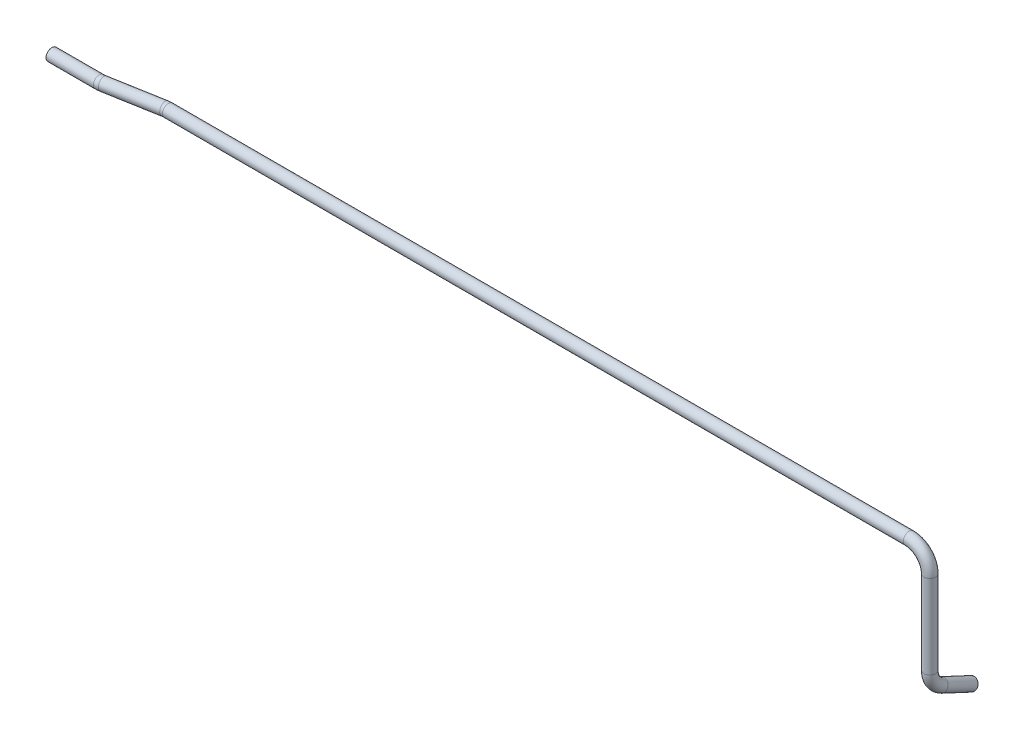
ISO-10303-21;
HEADER;
FILE_DESCRIPTION(('STEP AP214'),'2;1');
FILE_NAME('part.step','',(''),(''),'','','');
FILE_SCHEMA(('AUTOMOTIVE_DESIGN { 1 0 10303 214 1 1 1 1 }'));
ENDSEC;
DATA;
#1=APPLICATION_CONTEXT('core data for automotive mechanical design processes');
#2=APPLICATION_PROTOCOL_DEFINITION('international standard','automotive_design',2000,#1);
#3=PRODUCT_CONTEXT('',#1,'mechanical');
#4=PRODUCT('Part','Part','',(#3));
#5=PRODUCT_RELATED_PRODUCT_CATEGORY('part','',(#4));
#6=PRODUCT_DEFINITION_FORMATION('','',#4);
#7=PRODUCT_DEFINITION_CONTEXT('part definition',#1,'design');
#8=PRODUCT_DEFINITION('design','',#6,#7);
#9=PRODUCT_DEFINITION_SHAPE('','',#8);
#10=(LENGTH_UNIT() NAMED_UNIT(*) SI_UNIT(.MILLI.,.METRE.));
#11=(NAMED_UNIT(*) PLANE_ANGLE_UNIT() SI_UNIT($,.RADIAN.));
#12=(NAMED_UNIT(*) SI_UNIT($,.STERADIAN.) SOLID_ANGLE_UNIT());
#13=UNCERTAINTY_MEASURE_WITH_UNIT(LENGTH_MEASURE(1.E-05),#10,'distance_accuracy_value','');
#14=(GEOMETRIC_REPRESENTATION_CONTEXT(3) GLOBAL_UNCERTAINTY_ASSIGNED_CONTEXT((#13)) GLOBAL_UNIT_ASSIGNED_CONTEXT((#10,
#11,#12)) REPRESENTATION_CONTEXT('',''));
#15=CARTESIAN_POINT('',(0.,0.,0.));
#16=DIRECTION('',(0.,0.,1.));
#17=DIRECTION('',(1.,0.,0.));
#18=AXIS2_PLACEMENT_3D('',#15,#16,#17);
#19=CARTESIAN_POINT('',(883.44340509169,-125.153988050812,-22.1250165034454));
#20=DIRECTION('',(0.,-0.422618261740697,-0.906307787036651));
#21=DIRECTION('',(0.,0.906307787036651,-0.422618261740697));
#22=AXIS2_PLACEMENT_3D('',#19,#20,#21);
#23=CYLINDRICAL_SURFACE('',#22,6.);
#24=CARTESIAN_POINT('',(883.44340509169,-125.153988050812,-22.1250165034454));
#25=DIRECTION('',(0.,-0.422618261740698,-0.906307787036651));
#26=DIRECTION('',(0.,0.906307787036651,-0.422618261740698));
#27=AXIS2_PLACEMENT_3D('',#24,#25,#26);
#28=CIRCLE('',#27,6.);
#29=CARTESIAN_POINT('',(883.44340509169,-130.591834773032,-19.5893069330012));
#30=VERTEX_POINT('',#29);
#31=EDGE_CURVE('E47',#30,#30,#28,.T.);
#32=ORIENTED_EDGE('',*,*,#31,.T.);
#33=EDGE_LOOP('',(#32));
#34=FACE_BOUND('',#33,.T.);
#35=CARTESIAN_POINT('',(883.44340509169,-139.363058301813,-52.5964659907226));
#36=DIRECTION('',(0.,-0.422618261740698,-0.906307787036651));
#37=DIRECTION('',(0.,0.906307787036651,-0.422618261740698));
#38=AXIS2_PLACEMENT_3D('',#35,#36,#37);
#39=CIRCLE('',#38,6.);
#40=CARTESIAN_POINT('',(883.44340509169,-133.925211579593,-55.1321755611668));
#41=VERTEX_POINT('',#40);
#42=EDGE_CURVE('E10',#41,#41,#39,.T.);
#43=ORIENTED_EDGE('',*,*,#42,.F.);
#44=EDGE_LOOP('',(#43));
#45=FACE_BOUND('',#44,.T.);
#46=ADVANCED_FACE('F37',(#34,#45),#23,.T.);
#47=CARTESIAN_POINT('',(883.44340509169,-125.153988050812,-22.1250165034454));
#48=DIRECTION('',(0.,-0.422618261740697,-0.906307787036651));
#49=DIRECTION('',(0.,0.906307787036651,-0.422618261740697));
#50=AXIS2_PLACEMENT_3D('',#47,#48,#49);
#51=CYLINDRICAL_SURFACE('',#50,4.5);
#52=CARTESIAN_POINT('',(883.44340509169,-125.153988050812,-22.1250165034454));
#53=DIRECTION('',(0.,-0.422618261740698,-0.906307787036651));
#54=DIRECTION('',(0.,0.906307787036651,-0.422618261740698));
#55=AXIS2_PLACEMENT_3D('',#52,#53,#54);
#56=CIRCLE('',#55,4.5);
#57=CARTESIAN_POINT('',(883.44340509169,-129.232373092477,-20.2232343256122));
#58=VERTEX_POINT('',#57);
#59=EDGE_CURVE('E51',#58,#58,#56,.T.);
#60=ORIENTED_EDGE('',*,*,#59,.F.);
#61=EDGE_LOOP('',(#60));
#62=FACE_BOUND('',#61,.T.);
#63=CARTESIAN_POINT('',(883.44340509169,-139.363058301813,-52.5964659907226));
#64=DIRECTION('',(0.,-0.422618261740698,-0.906307787036651));
#65=DIRECTION('',(0.,0.906307787036651,-0.422618261740698));
#66=AXIS2_PLACEMENT_3D('',#63,#64,#65);
#67=CIRCLE('',#66,4.5);
#68=CARTESIAN_POINT('',(883.44340509169,-135.284673260148,-54.4982481685557));
#69=VERTEX_POINT('',#68);
#70=EDGE_CURVE('E43',#69,#69,#67,.T.);
#71=ORIENTED_EDGE('',*,*,#70,.T.);
#72=EDGE_LOOP('',(#71));
#73=FACE_BOUND('',#72,.T.);
#74=ADVANCED_FACE('F157',(#62,#73),#51,.F.);
#75=CARTESIAN_POINT('',(883.44340509169,-106.121524523043,-31.));
#76=DIRECTION('',(1.,0.,0.));
#77=DIRECTION('',(0.,0.,-1.));
#78=AXIS2_PLACEMENT_3D('',#75,#76,#77);
#79=TOROIDAL_SURFACE('',#78,21.,6.);
#80=CARTESIAN_POINT('',(883.44340509169,-106.121524523043,-10.));
#81=DIRECTION('',(0.,-1.,0.));
#82=DIRECTION('',(0.,0.,-1.));
#83=AXIS2_PLACEMENT_3D('',#80,#81,#82);
#84=CIRCLE('',#83,6.);
#85=CARTESIAN_POINT('',(883.44340509169,-106.121524523043,-4.));
#86=VERTEX_POINT('',#85);
#87=EDGE_CURVE('E56',#86,#86,#84,.T.);
#88=CARTESIAN_POINT('',(883.44340509169,-106.121524523043,-31.));
#89=DIRECTION('',(1.,0.,0.));
#90=DIRECTION('',(0.,0.,-1.));
#91=AXIS2_PLACEMENT_3D('',#88,#89,#90);
#92=CIRCLE('',#91,27.);
#93=EDGE_CURVE('',#86,#30,#92,.T.);
#94=ORIENTED_EDGE('',*,*,#87,.T.);
#95=ORIENTED_EDGE('',*,*,#31,.F.);
#96=ORIENTED_EDGE('',*,*,#93,.T.);
#97=ORIENTED_EDGE('',*,*,#93,.F.);
#98=EDGE_LOOP('',(#94,#96,#95,#97));
#99=FACE_BOUND('',#98,.T.);
#100=ADVANCED_FACE('F153',(#99),#79,.T.);
#101=CARTESIAN_POINT('',(883.44340509169,-106.121524523043,-31.));
#102=DIRECTION('',(1.,0.,0.));
#103=DIRECTION('',(0.,0.,-1.));
#104=AXIS2_PLACEMENT_3D('',#101,#102,#103);
#105=TOROIDAL_SURFACE('',#104,21.,4.5);
#106=CARTESIAN_POINT('',(883.44340509169,-106.121524523043,-10.));
#107=DIRECTION('',(0.,-1.,0.));
#108=DIRECTION('',(0.,0.,-1.));
#109=AXIS2_PLACEMENT_3D('',#106,#107,#108);
#110=CIRCLE('',#109,4.5);
#111=CARTESIAN_POINT('',(883.44340509169,-106.121524523043,-5.5));
#112=VERTEX_POINT('',#111);
#113=EDGE_CURVE('E59',#112,#112,#110,.T.);
#114=CARTESIAN_POINT('',(883.44340509169,-106.121524523043,-31.));
#115=DIRECTION('',(1.,0.,0.));
#116=DIRECTION('',(0.,0.,-1.));
#117=AXIS2_PLACEMENT_3D('',#114,#115,#116);
#118=CIRCLE('',#117,25.5);
#119=EDGE_CURVE('',#112,#58,#118,.T.);
#120=ORIENTED_EDGE('',*,*,#113,.F.);
#121=ORIENTED_EDGE('',*,*,#59,.T.);
#122=ORIENTED_EDGE('',*,*,#119,.T.);
#123=ORIENTED_EDGE('',*,*,#119,.F.);
#124=EDGE_LOOP('',(#120,#122,#121,#123));
#125=FACE_BOUND('',#124,.T.);
#126=ADVANCED_FACE('F150',(#125),#105,.F.);
#127=CARTESIAN_POINT('',(883.44340509169,-21.,-10.));
#128=DIRECTION('',(0.,-1.,0.));
#129=DIRECTION('',(0.,0.,-1.));
#130=AXIS2_PLACEMENT_3D('',#127,#128,#129);
#131=CYLINDRICAL_SURFACE('',#130,6.);
#132=CARTESIAN_POINT('',(883.44340509169,-21.,-10.));
#133=DIRECTION('',(0.,-1.,0.));
#134=DIRECTION('',(0.,0.,-1.));
#135=AXIS2_PLACEMENT_3D('',#132,#133,#134);
#136=CIRCLE('',#135,6.);
#137=CARTESIAN_POINT('',(889.44340509169,-21.,-10.));
#138=VERTEX_POINT('',#137);
#139=EDGE_CURVE('E62',#138,#138,#136,.T.);
#140=ORIENTED_EDGE('',*,*,#139,.T.);
#141=EDGE_LOOP('',(#140));
#142=FACE_BOUND('',#141,.T.);
#143=ORIENTED_EDGE('',*,*,#87,.F.);
#144=EDGE_LOOP('',(#143));
#145=FACE_BOUND('',#144,.T.);
#146=ADVANCED_FACE('F146',(#142,#145),#131,.T.);
#147=CARTESIAN_POINT('',(883.44340509169,-21.,-10.));
#148=DIRECTION('',(0.,-1.,0.));
#149=DIRECTION('',(0.,0.,-1.));
#150=AXIS2_PLACEMENT_3D('',#147,#148,#149);
#151=CYLINDRICAL_SURFACE('',#150,4.5);
#152=CARTESIAN_POINT('',(883.44340509169,-21.,-10.));
#153=DIRECTION('',(0.,-1.,0.));
#154=DIRECTION('',(0.,0.,-1.));
#155=AXIS2_PLACEMENT_3D('',#152,#153,#154);
#156=CIRCLE('',#155,4.5);
#157=CARTESIAN_POINT('',(887.94340509169,-21.,-10.));
#158=VERTEX_POINT('',#157);
#159=EDGE_CURVE('E65',#158,#158,#156,.T.);
#160=ORIENTED_EDGE('',*,*,#159,.F.);
#161=EDGE_LOOP('',(#160));
#162=FACE_BOUND('',#161,.T.);
#163=ORIENTED_EDGE('',*,*,#113,.T.);
#164=EDGE_LOOP('',(#163));
#165=FACE_BOUND('',#164,.T.);
#166=ADVANCED_FACE('F143',(#162,#165),#151,.F.);
#167=CARTESIAN_POINT('',(862.44340509169,-21.,-10.));
#168=DIRECTION('',(0.,0.,-1.));
#169=DIRECTION('',(-1.,0.,0.));
#170=AXIS2_PLACEMENT_3D('',#167,#168,#169);
#171=TOROIDAL_SURFACE('',#170,21.,6.);
#172=CARTESIAN_POINT('',(862.44340509169,0.,-10.));
#173=DIRECTION('',(1.,0.,0.));
#174=DIRECTION('',(0.,0.,-1.));
#175=AXIS2_PLACEMENT_3D('',#172,#173,#174);
#176=CIRCLE('',#175,6.);
#177=CARTESIAN_POINT('',(862.44340509169,6.,-10.));
#178=VERTEX_POINT('',#177);
#179=EDGE_CURVE('E68',#178,#178,#176,.T.);
#180=CARTESIAN_POINT('',(862.44340509169,-21.,-10.));
#181=DIRECTION('',(0.,0.,-1.));
#182=DIRECTION('',(-1.,0.,0.));
#183=AXIS2_PLACEMENT_3D('',#180,#181,#182);
#184=CIRCLE('',#183,27.);
#185=EDGE_CURVE('',#178,#138,#184,.T.);
#186=ORIENTED_EDGE('',*,*,#179,.T.);
#187=ORIENTED_EDGE('',*,*,#139,.F.);
#188=ORIENTED_EDGE('',*,*,#185,.T.);
#189=ORIENTED_EDGE('',*,*,#185,.F.);
#190=EDGE_LOOP('',(#186,#188,#187,#189));
#191=FACE_BOUND('',#190,.T.);
#192=ADVANCED_FACE('F139',(#191),#171,.T.);
#193=CARTESIAN_POINT('',(862.44340509169,-21.,-10.));
#194=DIRECTION('',(0.,0.,-1.));
#195=DIRECTION('',(-1.,0.,0.));
#196=AXIS2_PLACEMENT_3D('',#193,#194,#195);
#197=TOROIDAL_SURFACE('',#196,21.,4.5);
#198=CARTESIAN_POINT('',(862.44340509169,0.,-10.));
#199=DIRECTION('',(1.,0.,0.));
#200=DIRECTION('',(0.,0.,-1.));
#201=AXIS2_PLACEMENT_3D('',#198,#199,#200);
#202=CIRCLE('',#201,4.5);
#203=CARTESIAN_POINT('',(862.44340509169,4.5,-10.));
#204=VERTEX_POINT('',#203);
#205=EDGE_CURVE('E71',#204,#204,#202,.T.);
#206=CARTESIAN_POINT('',(862.44340509169,-21.,-10.));
#207=DIRECTION('',(0.,0.,-1.));
#208=DIRECTION('',(-1.,0.,0.));
#209=AXIS2_PLACEMENT_3D('',#206,#207,#208);
#210=CIRCLE('',#209,25.5);
#211=EDGE_CURVE('',#204,#158,#210,.T.);
#212=ORIENTED_EDGE('',*,*,#205,.F.);
#213=ORIENTED_EDGE('',*,*,#159,.T.);
#214=ORIENTED_EDGE('',*,*,#211,.T.);
#215=ORIENTED_EDGE('',*,*,#211,.F.);
#216=EDGE_LOOP('',(#212,#214,#213,#215));
#217=FACE_BOUND('',#216,.T.);
#218=ADVANCED_FACE('F136',(#217),#197,.F.);
#219=CARTESIAN_POINT('',(108.550080130221,0.,-10.));
#220=DIRECTION('',(1.,0.,0.));
#221=DIRECTION('',(0.,1.,0.));
#222=AXIS2_PLACEMENT_3D('',#219,#220,#221);
#223=CYLINDRICAL_SURFACE('',#222,6.);
#224=CARTESIAN_POINT('',(108.550080130221,0.,-10.));
#225=DIRECTION('',(1.,0.,0.));
#226=DIRECTION('',(0.,0.,-1.));
#227=AXIS2_PLACEMENT_3D('',#224,#225,#226);
#228=CIRCLE('',#227,6.);
#229=CARTESIAN_POINT('',(108.550080130221,0.,-16.));
#230=VERTEX_POINT('',#229);
#231=EDGE_CURVE('E74',#230,#230,#228,.T.);
#232=ORIENTED_EDGE('',*,*,#231,.T.);
#233=EDGE_LOOP('',(#232));
#234=FACE_BOUND('',#233,.T.);
#235=ORIENTED_EDGE('',*,*,#179,.F.);
#236=EDGE_LOOP('',(#235));
#237=FACE_BOUND('',#236,.T.);
#238=ADVANCED_FACE('F132',(#234,#237),#223,.T.);
#239=CARTESIAN_POINT('',(108.550080130221,0.,-10.));
#240=DIRECTION('',(1.,0.,0.));
#241=DIRECTION('',(0.,1.,0.));
#242=AXIS2_PLACEMENT_3D('',#239,#240,#241);
#243=CYLINDRICAL_SURFACE('',#242,4.5);
#244=CARTESIAN_POINT('',(108.550080130221,0.,-10.));
#245=DIRECTION('',(1.,0.,0.));
#246=DIRECTION('',(0.,0.,-1.));
#247=AXIS2_PLACEMENT_3D('',#244,#245,#246);
#248=CIRCLE('',#247,4.5);
#249=CARTESIAN_POINT('',(108.550080130221,0.,-14.5));
#250=VERTEX_POINT('',#249);
#251=EDGE_CURVE('E77',#250,#250,#248,.T.);
#252=ORIENTED_EDGE('',*,*,#251,.F.);
#253=EDGE_LOOP('',(#252));
#254=FACE_BOUND('',#253,.T.);
#255=ORIENTED_EDGE('',*,*,#205,.T.);
#256=EDGE_LOOP('',(#255));
#257=FACE_BOUND('',#256,.T.);
#258=ADVANCED_FACE('F129',(#254,#257),#243,.F.);
#259=CARTESIAN_POINT('',(108.550080130221,0.,11.));
#260=DIRECTION('',(0.,-1.,0.));
#261=DIRECTION('',(0.,0.,-1.));
#262=AXIS2_PLACEMENT_3D('',#259,#260,#261);
#263=TOROIDAL_SURFACE('',#262,21.,6.);
#264=CARTESIAN_POINT('',(104.903468399216,0.,-9.68096281325636));
#265=DIRECTION('',(0.984807753012208,0.,-0.173648177666931));
#266=DIRECTION('',(-0.173648177666931,0.,-0.984807753012208));
#267=AXIS2_PLACEMENT_3D('',#264,#265,#266);
#268=CIRCLE('',#267,6.);
#269=CARTESIAN_POINT('',(103.861579333214,0.,-15.5898093313296));
#270=VERTEX_POINT('',#269);
#271=EDGE_CURVE('E80',#270,#270,#268,.T.);
#272=CARTESIAN_POINT('',(108.550080130221,0.,11.));
#273=DIRECTION('',(0.,-1.,0.));
#274=DIRECTION('',(0.,0.,-1.));
#275=AXIS2_PLACEMENT_3D('',#272,#273,#274);
#276=CIRCLE('',#275,27.);
#277=EDGE_CURVE('',#270,#230,#276,.T.);
#278=ORIENTED_EDGE('',*,*,#271,.T.);
#279=ORIENTED_EDGE('',*,*,#231,.F.);
#280=ORIENTED_EDGE('',*,*,#277,.T.);
#281=ORIENTED_EDGE('',*,*,#277,.F.);
#282=EDGE_LOOP('',(#278,#280,#279,#281));
#283=FACE_BOUND('',#282,.T.);
#284=ADVANCED_FACE('F125',(#283),#263,.T.);
#285=CARTESIAN_POINT('',(108.550080130221,0.,11.));
#286=DIRECTION('',(0.,-1.,0.));
#287=DIRECTION('',(0.,0.,-1.));
#288=AXIS2_PLACEMENT_3D('',#285,#286,#287);
#289=TOROIDAL_SURFACE('',#288,21.,4.5);
#290=CARTESIAN_POINT('',(104.903468399216,0.,-9.68096281325636));
#291=DIRECTION('',(0.984807753012208,0.,-0.173648177666931));
#292=DIRECTION('',(-0.173648177666931,0.,-0.984807753012208));
#293=AXIS2_PLACEMENT_3D('',#290,#291,#292);
#294=CIRCLE('',#293,4.5);
#295=CARTESIAN_POINT('',(104.122051599715,0.,-14.1125977018113));
#296=VERTEX_POINT('',#295);
#297=EDGE_CURVE('E83',#296,#296,#294,.T.);
#298=CARTESIAN_POINT('',(108.550080130221,0.,11.));
#299=DIRECTION('',(0.,-1.,0.));
#300=DIRECTION('',(0.,0.,-1.));
#301=AXIS2_PLACEMENT_3D('',#298,#299,#300);
#302=CIRCLE('',#301,25.5);
#303=EDGE_CURVE('',#296,#250,#302,.T.);
#304=ORIENTED_EDGE('',*,*,#297,.F.);
#305=ORIENTED_EDGE('',*,*,#251,.T.);
#306=ORIENTED_EDGE('',*,*,#303,.T.);
#307=ORIENTED_EDGE('',*,*,#303,.F.);
#308=EDGE_LOOP('',(#304,#306,#305,#307));
#309=FACE_BOUND('',#308,.T.);
#310=ADVANCED_FACE('F122',(#309),#289,.F.);
#311=CARTESIAN_POINT('',(51.8093497969611,0.,-0.319037186743632));
#312=DIRECTION('',(0.984807753012208,0.,-0.173648177666931));
#313=DIRECTION('',(-0.173648177666931,0.,-0.984807753012208));
#314=AXIS2_PLACEMENT_3D('',#311,#312,#313);
#315=CYLINDRICAL_SURFACE('',#314,6.);
#316=CARTESIAN_POINT('',(51.8093497969611,0.,-0.319037186743632));
#317=DIRECTION('',(0.984807753012208,0.,-0.173648177666931));
#318=DIRECTION('',(-0.173648177666931,0.,-0.984807753012208));
#319=AXIS2_PLACEMENT_3D('',#316,#317,#318);
#320=CIRCLE('',#319,6.);
#321=CARTESIAN_POINT('',(52.8512388629627,0.,5.58980933132961));
#322=VERTEX_POINT('',#321);
#323=EDGE_CURVE('E86',#322,#322,#320,.T.);
#324=ORIENTED_EDGE('',*,*,#323,.T.);
#325=EDGE_LOOP('',(#324));
#326=FACE_BOUND('',#325,.T.);
#327=ORIENTED_EDGE('',*,*,#271,.F.);
#328=EDGE_LOOP('',(#327));
#329=FACE_BOUND('',#328,.T.);
#330=ADVANCED_FACE('F118',(#326,#329),#315,.T.);
#331=CARTESIAN_POINT('',(51.8093497969611,0.,-0.319037186743632));
#332=DIRECTION('',(0.984807753012208,0.,-0.173648177666931));
#333=DIRECTION('',(-0.173648177666931,0.,-0.984807753012208));
#334=AXIS2_PLACEMENT_3D('',#331,#332,#333);
#335=CYLINDRICAL_SURFACE('',#334,4.5);
#336=CARTESIAN_POINT('',(51.8093497969611,0.,-0.319037186743632));
#337=DIRECTION('',(0.984807753012208,0.,-0.173648177666931));
#338=DIRECTION('',(-0.173648177666931,0.,-0.984807753012208));
#339=AXIS2_PLACEMENT_3D('',#336,#337,#338);
#340=CIRCLE('',#339,4.5);
#341=CARTESIAN_POINT('',(52.5907665964623,0.,4.1125977018113));
#342=VERTEX_POINT('',#341);
#343=EDGE_CURVE('E89',#342,#342,#340,.T.);
#344=ORIENTED_EDGE('',*,*,#343,.F.);
#345=EDGE_LOOP('',(#344));
#346=FACE_BOUND('',#345,.T.);
#347=ORIENTED_EDGE('',*,*,#297,.T.);
#348=EDGE_LOOP('',(#347));
#349=FACE_BOUND('',#348,.T.);
#350=ADVANCED_FACE('F115',(#346,#349),#335,.F.);
#351=CARTESIAN_POINT('',(48.1627380659556,0.,-21.));
#352=DIRECTION('',(0.,1.,0.));
#353=DIRECTION('',(0.,0.,1.));
#354=AXIS2_PLACEMENT_3D('',#351,#352,#353);
#355=TOROIDAL_SURFACE('',#354,21.,6.);
#356=CARTESIAN_POINT('',(48.1627380659556,0.,0.));
#357=DIRECTION('',(1.,0.,0.));
#358=DIRECTION('',(0.,0.,-1.));
#359=AXIS2_PLACEMENT_3D('',#356,#357,#358);
#360=CIRCLE('',#359,6.);
#361=CARTESIAN_POINT('',(48.1627380659556,0.,6.));
#362=VERTEX_POINT('',#361);
#363=EDGE_CURVE('E92',#362,#362,#360,.T.);
#364=CARTESIAN_POINT('',(48.1627380659556,0.,-21.));
#365=DIRECTION('',(0.,1.,0.));
#366=DIRECTION('',(0.,0.,1.));
#367=AXIS2_PLACEMENT_3D('',#364,#365,#366);
#368=CIRCLE('',#367,27.);
#369=EDGE_CURVE('',#362,#322,#368,.T.);
#370=ORIENTED_EDGE('',*,*,#363,.T.);
#371=ORIENTED_EDGE('',*,*,#323,.F.);
#372=ORIENTED_EDGE('',*,*,#369,.T.);
#373=ORIENTED_EDGE('',*,*,#369,.F.);
#374=EDGE_LOOP('',(#370,#372,#371,#373));
#375=FACE_BOUND('',#374,.T.);
#376=ADVANCED_FACE('F111',(#375),#355,.T.);
#377=CARTESIAN_POINT('',(48.1627380659556,0.,-21.));
#378=DIRECTION('',(0.,1.,0.));
#379=DIRECTION('',(0.,0.,1.));
#380=AXIS2_PLACEMENT_3D('',#377,#378,#379);
#381=TOROIDAL_SURFACE('',#380,21.,4.5);
#382=CARTESIAN_POINT('',(48.1627380659556,0.,0.));
#383=DIRECTION('',(1.,0.,0.));
#384=DIRECTION('',(0.,0.,-1.));
#385=AXIS2_PLACEMENT_3D('',#382,#383,#384);
#386=CIRCLE('',#385,4.5);
#387=CARTESIAN_POINT('',(48.1627380659556,0.,4.5));
#388=VERTEX_POINT('',#387);
#389=EDGE_CURVE('E96',#388,#388,#386,.T.);
#390=CARTESIAN_POINT('',(48.1627380659556,0.,-21.));
#391=DIRECTION('',(0.,1.,0.));
#392=DIRECTION('',(0.,0.,1.));
#393=AXIS2_PLACEMENT_3D('',#390,#391,#392);
#394=CIRCLE('',#393,25.5);
#395=EDGE_CURVE('',#388,#342,#394,.T.);
#396=ORIENTED_EDGE('',*,*,#389,.F.);
#397=ORIENTED_EDGE('',*,*,#343,.T.);
#398=ORIENTED_EDGE('',*,*,#395,.T.);
#399=ORIENTED_EDGE('',*,*,#395,.F.);
#400=EDGE_LOOP('',(#396,#398,#397,#399));
#401=FACE_BOUND('',#400,.T.);
#402=ADVANCED_FACE('F108',(#401),#381,.F.);
#403=CARTESIAN_POINT('',(48.1627380659556,0.,0.));
#404=DIRECTION('',(-1.,0.,0.));
#405=DIRECTION('',(0.,0.,1.));
#406=AXIS2_PLACEMENT_3D('',#403,#404,#405);
#407=CYLINDRICAL_SURFACE('',#406,4.5);
#408=ORIENTED_EDGE('',*,*,#389,.T.);
#409=EDGE_LOOP('',(#408));
#410=FACE_BOUND('',#409,.T.);
#411=CARTESIAN_POINT('',(0.,0.,0.));
#412=DIRECTION('',(1.,0.,0.));
#413=DIRECTION('',(0.,0.,-1.));
#414=AXIS2_PLACEMENT_3D('',#411,#412,#413);
#415=CIRCLE('',#414,4.5);
#416=CARTESIAN_POINT('',(0.,0.,-4.5));
#417=VERTEX_POINT('',#416);
#418=EDGE_CURVE('E97',#417,#417,#415,.T.);
#419=ORIENTED_EDGE('',*,*,#418,.F.);
#420=EDGE_LOOP('',(#419));
#421=FACE_BOUND('',#420,.T.);
#422=ADVANCED_FACE('F105',(#410,#421),#407,.F.);
#423=CARTESIAN_POINT('',(48.1627380659556,0.,0.));
#424=DIRECTION('',(-1.,0.,0.));
#425=DIRECTION('',(0.,0.,1.));
#426=AXIS2_PLACEMENT_3D('',#423,#424,#425);
#427=CYLINDRICAL_SURFACE('',#426,6.);
#428=ORIENTED_EDGE('',*,*,#363,.F.);
#429=EDGE_LOOP('',(#428));
#430=FACE_BOUND('',#429,.T.);
#431=CARTESIAN_POINT('',(0.,0.,0.));
#432=DIRECTION('',(1.,0.,0.));
#433=DIRECTION('',(0.,0.,-1.));
#434=AXIS2_PLACEMENT_3D('',#431,#432,#433);
#435=CIRCLE('',#434,6.);
#436=CARTESIAN_POINT('',(0.,0.,-6.));
#437=VERTEX_POINT('',#436);
#438=EDGE_CURVE('E93',#437,#437,#435,.T.);
#439=ORIENTED_EDGE('',*,*,#438,.T.);
#440=EDGE_LOOP('',(#439));
#441=FACE_BOUND('',#440,.T.);
#442=ADVANCED_FACE('F187',(#430,#441),#427,.T.);
#443=CARTESIAN_POINT('',(883.44340509169,-139.363058301813,-52.5964659907226));
#444=DIRECTION('',(0.,-0.422618261740698,-0.906307787036651));
#445=DIRECTION('',(0.,0.906307787036651,-0.422618261740698));
#446=AXIS2_PLACEMENT_3D('',#443,#444,#445);
#447=PLANE('',#446);
#448=ORIENTED_EDGE('',*,*,#70,.F.);
#449=EDGE_LOOP('',(#448));
#450=FACE_BOUND('',#449,.T.);
#451=ORIENTED_EDGE('',*,*,#42,.T.);
#452=EDGE_LOOP('',(#451));
#453=FACE_BOUND('',#452,.T.);
#454=ADVANCED_FACE('F190',(#450,#453),#447,.T.);
#455=CARTESIAN_POINT('',(0.,0.,0.));
#456=DIRECTION('',(1.,0.,0.));
#457=DIRECTION('',(0.,0.,-1.));
#458=AXIS2_PLACEMENT_3D('',#455,#456,#457);
#459=PLANE('',#458);
#460=ORIENTED_EDGE('',*,*,#418,.T.);
#461=EDGE_LOOP('',(#460));
#462=FACE_BOUND('',#461,.T.);
#463=ORIENTED_EDGE('',*,*,#438,.F.);
#464=EDGE_LOOP('',(#463));
#465=FACE_BOUND('',#464,.T.);
#466=ADVANCED_FACE('F192',(#462,#465),#459,.F.);
#467=CLOSED_SHELL('',(#46,#74,#100,#126,#146,#166,#192,#218,#238,#258,#284,#310,#330,#350,#376,
#402,#422,#442,#454,#466));
#468=MANIFOLD_SOLID_BREP('B2',#467);
#469=ADVANCED_BREP_SHAPE_REPRESENTATION('',(#18,#468),#14);
#470=SHAPE_DEFINITION_REPRESENTATION(#9,#469);
ENDSEC;
END-ISO-10303-21;
